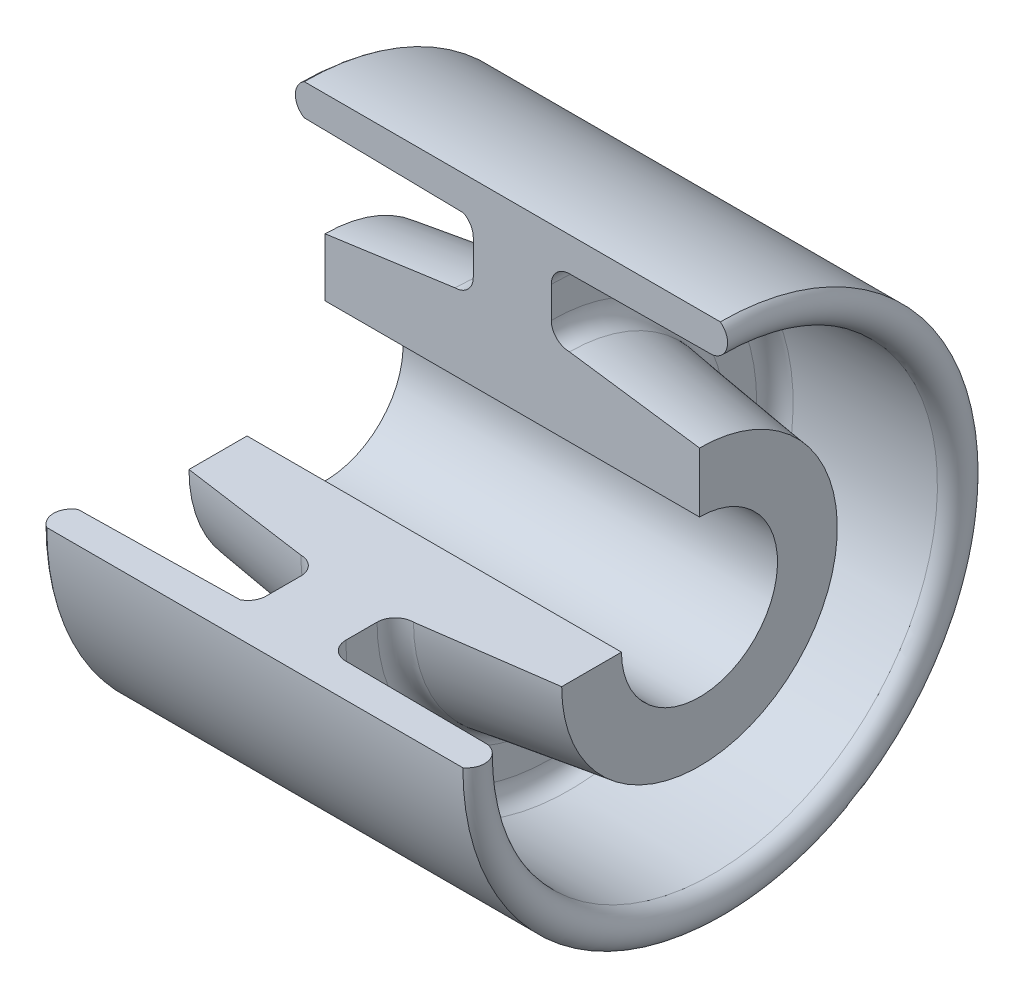
ISO-10303-21;
HEADER;
FILE_DESCRIPTION(('STEP AP214'),'2;1');
FILE_NAME('part.step','',(''),(''),'','','');
FILE_SCHEMA(('AUTOMOTIVE_DESIGN { 1 0 10303 214 1 1 1 1 }'));
ENDSEC;
DATA;
#1=APPLICATION_CONTEXT('core data for automotive mechanical design processes');
#2=APPLICATION_PROTOCOL_DEFINITION('international standard','automotive_design',2000,#1);
#3=PRODUCT_CONTEXT('',#1,'mechanical');
#4=PRODUCT('Part','Part','',(#3));
#5=PRODUCT_RELATED_PRODUCT_CATEGORY('part','',(#4));
#6=PRODUCT_DEFINITION_FORMATION('','',#4);
#7=PRODUCT_DEFINITION_CONTEXT('part definition',#1,'design');
#8=PRODUCT_DEFINITION('design','',#6,#7);
#9=PRODUCT_DEFINITION_SHAPE('','',#8);
#10=(LENGTH_UNIT() NAMED_UNIT(*) SI_UNIT(.MILLI.,.METRE.));
#11=(NAMED_UNIT(*) PLANE_ANGLE_UNIT() SI_UNIT($,.RADIAN.));
#12=(NAMED_UNIT(*) SI_UNIT($,.STERADIAN.) SOLID_ANGLE_UNIT());
#13=UNCERTAINTY_MEASURE_WITH_UNIT(LENGTH_MEASURE(1.E-05),#10,'distance_accuracy_value','');
#14=(GEOMETRIC_REPRESENTATION_CONTEXT(3) GLOBAL_UNCERTAINTY_ASSIGNED_CONTEXT((#13)) GLOBAL_UNIT_ASSIGNED_CONTEXT((#10,
#11,#12)) REPRESENTATION_CONTEXT('',''));
#15=CARTESIAN_POINT('',(0.,0.,0.));
#16=DIRECTION('',(0.,0.,1.));
#17=DIRECTION('',(1.,0.,0.));
#18=AXIS2_PLACEMENT_3D('',#15,#16,#17);
#19=CARTESIAN_POINT('',(-48.8480035448024,-18.9717920228078,0.));
#20=DIRECTION('',(1.,0.,0.));
#21=DIRECTION('',(0.,0.,-1.));
#22=AXIS2_PLACEMENT_3D('',#19,#20,#21);
#23=TOROIDAL_SURFACE('',#22,46.4888835818629,3.5);
#24=CARTESIAN_POINT('',(-50.632149815831,-18.9717920228078,0.));
#25=DIRECTION('',(1.,0.,0.));
#26=DIRECTION('',(0.,0.,-1.));
#27=AXIS2_PLACEMENT_3D('',#24,#25,#26);
#28=CIRCLE('',#27,43.4777671637258);
#29=CARTESIAN_POINT('',(-50.632149815831,-18.9717920228073,43.4777671637258));
#30=VERTEX_POINT('',#29);
#31=CARTESIAN_POINT('',(-50.632149815831,24.505975140918,0.));
#32=VERTEX_POINT('',#31);
#33=EDGE_CURVE('E11',#30,#32,#28,.T.);
#34=ORIENTED_EDGE('',*,*,#33,.T.);
#35=CARTESIAN_POINT('',(-48.8480035448024,27.5170915590551,0.));
#36=DIRECTION('',(0.,0.,1.));
#37=DIRECTION('',(1.,0.,0.));
#38=AXIS2_PLACEMENT_3D('',#35,#36,#37);
#39=CIRCLE('',#38,3.5);
#40=CARTESIAN_POINT('',(-50.632149815831,30.5282079771922,0.));
#41=VERTEX_POINT('',#40);
#42=EDGE_CURVE('E148',#41,#32,#39,.T.);
#43=ORIENTED_EDGE('',*,*,#42,.F.);
#44=CARTESIAN_POINT('',(-50.632149815831,-18.9717920228078,0.));
#45=DIRECTION('',(1.,0.,0.));
#46=DIRECTION('',(0.,0.,-1.));
#47=AXIS2_PLACEMENT_3D('',#44,#45,#46);
#48=CIRCLE('',#47,49.5);
#49=CARTESIAN_POINT('',(-50.632149815831,-18.9717920228073,49.5));
#50=VERTEX_POINT('',#49);
#51=EDGE_CURVE('E51',#50,#41,#48,.T.);
#52=ORIENTED_EDGE('',*,*,#51,.F.);
#53=CARTESIAN_POINT('',(-48.8480035448024,-18.9717920228073,46.4888835818629));
#54=DIRECTION('',(0.,-1.,0.));
#55=DIRECTION('',(1.,0.,0.));
#56=AXIS2_PLACEMENT_3D('',#53,#54,#55);
#57=CIRCLE('',#56,3.5);
#58=EDGE_CURVE('E150',#50,#30,#57,.T.);
#59=ORIENTED_EDGE('',*,*,#58,.T.);
#60=EDGE_LOOP('',(#34,#43,#52,#59));
#61=FACE_BOUND('',#60,.T.);
#62=ADVANCED_FACE('F36',(#61),#23,.T.);
#63=CARTESIAN_POINT('',(-50.632149815831,-18.9717920228078,0.));
#64=DIRECTION('',(-1.,0.,0.));
#65=DIRECTION('',(0.,0.,1.));
#66=AXIS2_PLACEMENT_3D('',#63,#64,#65);
#67=CONICAL_SURFACE('',#66,43.4777671637258,0.0173716037724723);
#68=CARTESIAN_POINT('',(-20.0232094755942,-18.9717920228078,0.));
#69=DIRECTION('',(1.,0.,0.));
#70=DIRECTION('',(0.,0.,-1.));
#71=AXIS2_PLACEMENT_3D('',#68,#69,#70);
#72=CIRCLE('',#71,42.9459872869619);
#73=CARTESIAN_POINT('',(-20.0232094755942,-18.9717920228074,42.9459872869619));
#74=VERTEX_POINT('',#73);
#75=CARTESIAN_POINT('',(-20.0232094755942,23.9741952641541,0.));
#76=VERTEX_POINT('',#75);
#77=EDGE_CURVE('E44',#74,#76,#72,.T.);
#78=ORIENTED_EDGE('',*,*,#77,.T.);
#79=DIRECTION('',(0.999849117485594,-0.0173707300732649,0.));
#80=VECTOR('',#79,1.);
#81=CARTESIAN_POINT('',(-50.632149815831,24.505975140918,0.));
#82=LINE('',#81,#80);
#83=EDGE_CURVE('E159',#32,#76,#82,.T.);
#84=ORIENTED_EDGE('',*,*,#83,.F.);
#85=ORIENTED_EDGE('',*,*,#33,.F.);
#86=DIRECTION('',(0.999849117485594,0.,-0.0173707300732649));
#87=VECTOR('',#86,1.);
#88=CARTESIAN_POINT('',(-50.632149815831,-18.9717920228073,43.4777671637258));
#89=LINE('',#88,#87);
#90=EDGE_CURVE('E205',#30,#74,#89,.T.);
#91=ORIENTED_EDGE('',*,*,#90,.T.);
#92=EDGE_LOOP('',(#78,#84,#85,#91));
#93=FACE_BOUND('',#92,.T.);
#94=ADVANCED_FACE('F38',(#93),#67,.F.);
#95=CARTESIAN_POINT('',(-21.632149815831,-18.9717920228078,0.));
#96=DIRECTION('',(1.,0.,0.));
#97=DIRECTION('',(0.,0.,-1.));
#98=AXIS2_PLACEMENT_3D('',#95,#96,#97);
#99=TOROIDAL_SURFACE('',#98,39.8377223398316,3.5);
#100=CARTESIAN_POINT('',(-18.132149815831,-18.9717920228078,0.));
#101=DIRECTION('',(1.,0.,0.));
#102=DIRECTION('',(0.,0.,-1.));
#103=AXIS2_PLACEMENT_3D('',#100,#101,#102);
#104=CIRCLE('',#103,39.8377223398316);
#105=CARTESIAN_POINT('',(-18.132149815831,-18.9717920228074,39.8377223398316));
#106=VERTEX_POINT('',#105);
#107=CARTESIAN_POINT('',(-18.132149815831,20.8659303170238,0.));
#108=VERTEX_POINT('',#107);
#109=EDGE_CURVE('E271',#106,#108,#104,.T.);
#110=ORIENTED_EDGE('',*,*,#109,.T.);
#111=CARTESIAN_POINT('',(-21.632149815831,20.8659303170238,0.));
#112=DIRECTION('',(0.,0.,-1.));
#113=DIRECTION('',(1.,0.,0.));
#114=AXIS2_PLACEMENT_3D('',#111,#112,#113);
#115=CIRCLE('',#114,3.5);
#116=EDGE_CURVE('E164',#76,#108,#115,.T.);
#117=ORIENTED_EDGE('',*,*,#116,.F.);
#118=ORIENTED_EDGE('',*,*,#77,.F.);
#119=CARTESIAN_POINT('',(-21.632149815831,-18.9717920228074,39.8377223398316));
#120=DIRECTION('',(0.,1.,0.));
#121=DIRECTION('',(1.,0.,0.));
#122=AXIS2_PLACEMENT_3D('',#119,#120,#121);
#123=CIRCLE('',#122,3.5);
#124=EDGE_CURVE('E207',#74,#106,#123,.T.);
#125=ORIENTED_EDGE('',*,*,#124,.T.);
#126=EDGE_LOOP('',(#110,#117,#118,#125));
#127=FACE_BOUND('',#126,.T.);
#128=ADVANCED_FACE('F273',(#127),#99,.F.);
#129=CARTESIAN_POINT('',(-18.132149815831,-18.9717920228074,39.8377223398316));
#130=DIRECTION('',(-1.,0.,0.));
#131=DIRECTION('',(0.,0.,1.));
#132=AXIS2_PLACEMENT_3D('',#129,#130,#131);
#133=PLANE('',#132);
#134=CARTESIAN_POINT('',(-18.132149815831,-18.9717920228078,0.));
#135=DIRECTION('',(1.,0.,0.));
#136=DIRECTION('',(0.,0.,-1.));
#137=AXIS2_PLACEMENT_3D('',#134,#135,#136);
#138=CIRCLE('',#137,33.1622776601684);
#139=CARTESIAN_POINT('',(-18.132149815831,-18.9717920228075,33.1622776601684));
#140=VERTEX_POINT('',#139);
#141=CARTESIAN_POINT('',(-18.132149815831,14.1904856373606,0.));
#142=VERTEX_POINT('',#141);
#143=EDGE_CURVE('E269',#140,#142,#138,.T.);
#144=ORIENTED_EDGE('',*,*,#143,.T.);
#145=DIRECTION('',(0.,-1.,0.));
#146=VECTOR('',#145,1.);
#147=CARTESIAN_POINT('',(-18.132149815831,20.8659303170238,0.));
#148=LINE('',#147,#146);
#149=EDGE_CURVE('E166',#108,#142,#148,.T.);
#150=ORIENTED_EDGE('',*,*,#149,.F.);
#151=ORIENTED_EDGE('',*,*,#109,.F.);
#152=DIRECTION('',(0.,0.,-1.));
#153=VECTOR('',#152,1.);
#154=CARTESIAN_POINT('',(-18.132149815831,-18.9717920228074,39.8377223398316));
#155=LINE('',#154,#153);
#156=EDGE_CURVE('E210',#106,#140,#155,.T.);
#157=ORIENTED_EDGE('',*,*,#156,.T.);
#158=EDGE_LOOP('',(#144,#150,#151,#157));
#159=FACE_BOUND('',#158,.T.);
#160=ADVANCED_FACE('F279',(#159),#133,.T.);
#161=CARTESIAN_POINT('',(-21.632149815831,-18.9717920228078,0.));
#162=DIRECTION('',(1.,0.,0.));
#163=DIRECTION('',(0.,0.,-1.));
#164=AXIS2_PLACEMENT_3D('',#161,#162,#163);
#165=TOROIDAL_SURFACE('',#164,33.1622776601684,3.5);
#166=CARTESIAN_POINT('',(-21.632149815831,-18.9717920228078,0.));
#167=DIRECTION('',(1.,0.,0.));
#168=DIRECTION('',(0.,0.,-1.));
#169=AXIS2_PLACEMENT_3D('',#166,#167,#168);
#170=CIRCLE('',#169,29.6622776601684);
#171=CARTESIAN_POINT('',(-21.632149815831,-18.9717920228075,29.6622776601684));
#172=VERTEX_POINT('',#171);
#173=CARTESIAN_POINT('',(-21.632149815831,10.6904856373606,0.));
#174=VERTEX_POINT('',#173);
#175=EDGE_CURVE('E267',#172,#174,#170,.T.);
#176=ORIENTED_EDGE('',*,*,#175,.T.);
#177=CARTESIAN_POINT('',(-21.632149815831,14.1904856373606,0.));
#178=DIRECTION('',(0.,0.,-1.));
#179=DIRECTION('',(1.,0.,0.));
#180=AXIS2_PLACEMENT_3D('',#177,#178,#179);
#181=CIRCLE('',#180,3.5);
#182=EDGE_CURVE('E171',#142,#174,#181,.T.);
#183=ORIENTED_EDGE('',*,*,#182,.F.);
#184=ORIENTED_EDGE('',*,*,#143,.F.);
#185=CARTESIAN_POINT('',(-21.632149815831,-18.9717920228075,33.1622776601684));
#186=DIRECTION('',(0.,1.,0.));
#187=DIRECTION('',(1.,0.,0.));
#188=AXIS2_PLACEMENT_3D('',#185,#186,#187);
#189=CIRCLE('',#188,3.5);
#190=EDGE_CURVE('E213',#140,#172,#189,.T.);
#191=ORIENTED_EDGE('',*,*,#190,.T.);
#192=EDGE_LOOP('',(#176,#183,#184,#191));
#193=FACE_BOUND('',#192,.T.);
#194=ADVANCED_FACE('F282',(#193),#165,.F.);
#195=CARTESIAN_POINT('',(-21.632149815831,-18.9717920228078,0.));
#196=DIRECTION('',(1.,0.,0.));
#197=DIRECTION('',(0.,0.,-1.));
#198=AXIS2_PLACEMENT_3D('',#195,#196,#197);
#199=CONICAL_SURFACE('',#198,29.6622776601684,0.139095941482072);
#200=CARTESIAN_POINT('',(-46.632149815831,-18.9717920228078,0.));
#201=DIRECTION('',(1.,0.,0.));
#202=DIRECTION('',(0.,0.,-1.));
#203=AXIS2_PLACEMENT_3D('',#200,#201,#202);
#204=CIRCLE('',#203,26.1622776601684);
#205=CARTESIAN_POINT('',(-46.632149815831,-18.9717920228075,26.1622776601684));
#206=VERTEX_POINT('',#205);
#207=CARTESIAN_POINT('',(-46.632149815831,7.19048563736057,0.));
#208=VERTEX_POINT('',#207);
#209=EDGE_CURVE('E265',#206,#208,#204,.T.);
#210=ORIENTED_EDGE('',*,*,#209,.T.);
#211=DIRECTION('',(-0.99034174667433,-0.138647844534407,0.));
#212=VECTOR('',#211,1.);
#213=CARTESIAN_POINT('',(-46.632149815831,7.19048563736057,0.));
#214=LINE('',#213,#212);
#215=EDGE_CURVE('E174',#174,#208,#214,.T.);
#216=ORIENTED_EDGE('',*,*,#215,.F.);
#217=ORIENTED_EDGE('',*,*,#175,.F.);
#218=DIRECTION('',(-0.99034174667433,0.,-0.138647844534407));
#219=VECTOR('',#218,1.);
#220=CARTESIAN_POINT('',(-46.632149815831,-18.9717920228075,26.1622776601684));
#221=LINE('',#220,#219);
#222=EDGE_CURVE('E216',#172,#206,#221,.T.);
#223=ORIENTED_EDGE('',*,*,#222,.T.);
#224=EDGE_LOOP('',(#210,#216,#217,#223));
#225=FACE_BOUND('',#224,.T.);
#226=ADVANCED_FACE('F287',(#225),#199,.T.);
#227=CARTESIAN_POINT('',(-46.632149815831,-18.9717920228076,15.));
#228=DIRECTION('',(-1.,0.,0.));
#229=DIRECTION('',(0.,0.,1.));
#230=AXIS2_PLACEMENT_3D('',#227,#228,#229);
#231=PLANE('',#230);
#232=CARTESIAN_POINT('',(-46.632149815831,-18.9717920228078,0.));
#233=DIRECTION('',(1.,0.,0.));
#234=DIRECTION('',(0.,0.,-1.));
#235=AXIS2_PLACEMENT_3D('',#232,#233,#234);
#236=CIRCLE('',#235,15.);
#237=CARTESIAN_POINT('',(-46.632149815831,-18.9717920228076,15.));
#238=VERTEX_POINT('',#237);
#239=CARTESIAN_POINT('',(-46.632149815831,-3.97179202280781,0.));
#240=VERTEX_POINT('',#239);
#241=EDGE_CURVE('E263',#238,#240,#236,.T.);
#242=ORIENTED_EDGE('',*,*,#241,.T.);
#243=DIRECTION('',(0.,-1.,0.));
#244=VECTOR('',#243,1.);
#245=CARTESIAN_POINT('',(-46.632149815831,-3.97179202280781,0.));
#246=LINE('',#245,#244);
#247=EDGE_CURVE('E177',#208,#240,#246,.T.);
#248=ORIENTED_EDGE('',*,*,#247,.F.);
#249=ORIENTED_EDGE('',*,*,#209,.F.);
#250=DIRECTION('',(0.,0.,-1.));
#251=VECTOR('',#250,1.);
#252=CARTESIAN_POINT('',(-46.632149815831,-18.9717920228076,15.));
#253=LINE('',#252,#251);
#254=EDGE_CURVE('E219',#206,#238,#253,.T.);
#255=ORIENTED_EDGE('',*,*,#254,.T.);
#256=EDGE_LOOP('',(#242,#248,#249,#255));
#257=FACE_BOUND('',#256,.T.);
#258=ADVANCED_FACE('F290',(#257),#231,.T.);
#259=CARTESIAN_POINT('',(35.3913131479671,-18.9717920228078,0.));
#260=DIRECTION('',(1.,0.,0.));
#261=DIRECTION('',(0.,0.,-1.));
#262=AXIS2_PLACEMENT_3D('',#259,#260,#261);
#263=CYLINDRICAL_SURFACE('',#262,15.);
#264=CARTESIAN_POINT('',(25.367850184169,-18.9717920228078,0.));
#265=DIRECTION('',(1.,0.,0.));
#266=DIRECTION('',(0.,0.,-1.));
#267=AXIS2_PLACEMENT_3D('',#264,#265,#266);
#268=CIRCLE('',#267,15.);
#269=CARTESIAN_POINT('',(25.367850184169,-18.9717920228076,15.));
#270=VERTEX_POINT('',#269);
#271=CARTESIAN_POINT('',(25.367850184169,-3.97179202280779,0.));
#272=VERTEX_POINT('',#271);
#273=EDGE_CURVE('E261',#270,#272,#268,.T.);
#274=ORIENTED_EDGE('',*,*,#273,.T.);
#275=DIRECTION('',(1.,0.,0.));
#276=VECTOR('',#275,1.);
#277=CARTESIAN_POINT('',(-46.632149815831,-3.97179202280781,0.));
#278=LINE('',#277,#276);
#279=EDGE_CURVE('E180',#240,#272,#278,.T.);
#280=ORIENTED_EDGE('',*,*,#279,.F.);
#281=ORIENTED_EDGE('',*,*,#241,.F.);
#282=DIRECTION('',(1.,0.,0.));
#283=VECTOR('',#282,1.);
#284=CARTESIAN_POINT('',(-46.632149815831,-18.9717920228076,15.));
#285=LINE('',#284,#283);
#286=EDGE_CURVE('E222',#238,#270,#285,.T.);
#287=ORIENTED_EDGE('',*,*,#286,.T.);
#288=EDGE_LOOP('',(#274,#280,#281,#287));
#289=FACE_BOUND('',#288,.T.);
#290=ADVANCED_FACE('F295',(#289),#263,.F.);
#291=CARTESIAN_POINT('',(25.367850184169,-18.9717920228076,15.));
#292=DIRECTION('',(1.,0.,0.));
#293=DIRECTION('',(0.,0.,-1.));
#294=AXIS2_PLACEMENT_3D('',#291,#292,#293);
#295=PLANE('',#294);
#296=CARTESIAN_POINT('',(25.367850184169,-18.9717920228078,0.));
#297=DIRECTION('',(1.,0.,0.));
#298=DIRECTION('',(0.,0.,-1.));
#299=AXIS2_PLACEMENT_3D('',#296,#297,#298);
#300=CIRCLE('',#299,26.5);
#301=CARTESIAN_POINT('',(25.367850184169,-18.9717920228075,26.5));
#302=VERTEX_POINT('',#301);
#303=CARTESIAN_POINT('',(25.367850184169,7.52820797719218,0.));
#304=VERTEX_POINT('',#303);
#305=EDGE_CURVE('E259',#302,#304,#300,.T.);
#306=ORIENTED_EDGE('',*,*,#305,.T.);
#307=DIRECTION('',(0.,1.,0.));
#308=VECTOR('',#307,1.);
#309=CARTESIAN_POINT('',(25.367850184169,-3.97179202280779,0.));
#310=LINE('',#309,#308);
#311=EDGE_CURVE('E183',#272,#304,#310,.T.);
#312=ORIENTED_EDGE('',*,*,#311,.F.);
#313=ORIENTED_EDGE('',*,*,#273,.F.);
#314=DIRECTION('',(0.,0.,1.));
#315=VECTOR('',#314,1.);
#316=CARTESIAN_POINT('',(25.367850184169,-18.9717920228076,15.));
#317=LINE('',#316,#315);
#318=EDGE_CURVE('E225',#270,#302,#317,.T.);
#319=ORIENTED_EDGE('',*,*,#318,.T.);
#320=EDGE_LOOP('',(#306,#312,#313,#319));
#321=FACE_BOUND('',#320,.T.);
#322=ADVANCED_FACE('F298',(#321),#295,.T.);
#323=CARTESIAN_POINT('',(25.367850184169,-18.9717920228078,0.));
#324=DIRECTION('',(-1.,0.,0.));
#325=DIRECTION('',(0.,0.,1.));
#326=AXIS2_PLACEMENT_3D('',#323,#324,#325);
#327=CONICAL_SURFACE('',#326,26.5,0.139095941482072);
#328=CARTESIAN_POINT('',(0.367850184169023,-18.9717920228078,0.));
#329=DIRECTION('',(1.,0.,0.));
#330=DIRECTION('',(0.,0.,-1.));
#331=AXIS2_PLACEMENT_3D('',#328,#329,#330);
#332=CIRCLE('',#331,30.);
#333=CARTESIAN_POINT('',(0.36785018416902,-18.9717920228075,30.));
#334=VERTEX_POINT('',#333);
#335=CARTESIAN_POINT('',(0.36785018416902,11.0282079771922,0.));
#336=VERTEX_POINT('',#335);
#337=EDGE_CURVE('E257',#334,#336,#332,.T.);
#338=ORIENTED_EDGE('',*,*,#337,.T.);
#339=DIRECTION('',(-0.99034174667433,0.138647844534407,0.));
#340=VECTOR('',#339,1.);
#341=CARTESIAN_POINT('',(25.367850184169,7.52820797719218,0.));
#342=LINE('',#341,#340);
#343=EDGE_CURVE('E186',#304,#336,#342,.T.);
#344=ORIENTED_EDGE('',*,*,#343,.F.);
#345=ORIENTED_EDGE('',*,*,#305,.F.);
#346=DIRECTION('',(-0.99034174667433,0.,0.138647844534407));
#347=VECTOR('',#346,1.);
#348=CARTESIAN_POINT('',(25.367850184169,-18.9717920228075,26.5));
#349=LINE('',#348,#347);
#350=EDGE_CURVE('E228',#302,#334,#349,.T.);
#351=ORIENTED_EDGE('',*,*,#350,.T.);
#352=EDGE_LOOP('',(#338,#344,#345,#351));
#353=FACE_BOUND('',#352,.T.);
#354=ADVANCED_FACE('F303',(#353),#327,.T.);
#355=CARTESIAN_POINT('',(0.367850184169027,-18.9717920228078,0.));
#356=DIRECTION('',(1.,0.,0.));
#357=DIRECTION('',(0.,0.,-1.));
#358=AXIS2_PLACEMENT_3D('',#355,#356,#357);
#359=TOROIDAL_SURFACE('',#358,33.5,3.5);
#360=CARTESIAN_POINT('',(-3.13214981583097,-18.9717920228078,0.));
#361=DIRECTION('',(1.,0.,0.));
#362=DIRECTION('',(0.,0.,-1.));
#363=AXIS2_PLACEMENT_3D('',#360,#361,#362);
#364=CIRCLE('',#363,33.5);
#365=CARTESIAN_POINT('',(-3.13214981583097,-18.9717920228075,33.5));
#366=VERTEX_POINT('',#365);
#367=CARTESIAN_POINT('',(-3.13214981583097,14.5282079771922,0.));
#368=VERTEX_POINT('',#367);
#369=EDGE_CURVE('E255',#366,#368,#364,.T.);
#370=ORIENTED_EDGE('',*,*,#369,.T.);
#371=CARTESIAN_POINT('',(0.367850184169027,14.5282079771922,0.));
#372=DIRECTION('',(0.,0.,-1.));
#373=DIRECTION('',(1.,0.,0.));
#374=AXIS2_PLACEMENT_3D('',#371,#372,#373);
#375=CIRCLE('',#374,3.5);
#376=EDGE_CURVE('E189',#336,#368,#375,.T.);
#377=ORIENTED_EDGE('',*,*,#376,.F.);
#378=ORIENTED_EDGE('',*,*,#337,.F.);
#379=CARTESIAN_POINT('',(0.367850184169027,-18.9717920228075,33.5));
#380=DIRECTION('',(0.,1.,0.));
#381=DIRECTION('',(1.,0.,0.));
#382=AXIS2_PLACEMENT_3D('',#379,#380,#381);
#383=CIRCLE('',#382,3.5);
#384=EDGE_CURVE('E231',#334,#366,#383,.T.);
#385=ORIENTED_EDGE('',*,*,#384,.T.);
#386=EDGE_LOOP('',(#370,#377,#378,#385));
#387=FACE_BOUND('',#386,.T.);
#388=ADVANCED_FACE('F306',(#387),#359,.F.);
#389=CARTESIAN_POINT('',(-3.13214981583097,-18.9717920228074,39.5));
#390=DIRECTION('',(1.,0.,0.));
#391=DIRECTION('',(0.,0.,-1.));
#392=AXIS2_PLACEMENT_3D('',#389,#390,#391);
#393=PLANE('',#392);
#394=CARTESIAN_POINT('',(-3.13214981583097,-18.9717920228078,0.));
#395=DIRECTION('',(1.,0.,0.));
#396=DIRECTION('',(0.,0.,-1.));
#397=AXIS2_PLACEMENT_3D('',#394,#395,#396);
#398=CIRCLE('',#397,39.5);
#399=CARTESIAN_POINT('',(-3.13214981583097,-18.9717920228074,39.5));
#400=VERTEX_POINT('',#399);
#401=CARTESIAN_POINT('',(-3.13214981583097,20.5282079771922,0.));
#402=VERTEX_POINT('',#401);
#403=EDGE_CURVE('E253',#400,#402,#398,.T.);
#404=ORIENTED_EDGE('',*,*,#403,.T.);
#405=DIRECTION('',(0.,1.,0.));
#406=VECTOR('',#405,1.);
#407=CARTESIAN_POINT('',(-3.13214981583097,20.5282079771922,0.));
#408=LINE('',#407,#406);
#409=EDGE_CURVE('E192',#368,#402,#408,.T.);
#410=ORIENTED_EDGE('',*,*,#409,.F.);
#411=ORIENTED_EDGE('',*,*,#369,.F.);
#412=DIRECTION('',(0.,0.,1.));
#413=VECTOR('',#412,1.);
#414=CARTESIAN_POINT('',(-3.13214981583097,-18.9717920228074,39.5));
#415=LINE('',#414,#413);
#416=EDGE_CURVE('E234',#366,#400,#415,.T.);
#417=ORIENTED_EDGE('',*,*,#416,.T.);
#418=EDGE_LOOP('',(#404,#410,#411,#417));
#419=FACE_BOUND('',#418,.T.);
#420=ADVANCED_FACE('F311',(#419),#393,.T.);
#421=CARTESIAN_POINT('',(0.367850184169026,-18.9717920228078,0.));
#422=DIRECTION('',(1.,0.,0.));
#423=DIRECTION('',(0.,0.,-1.));
#424=AXIS2_PLACEMENT_3D('',#421,#422,#423);
#425=TOROIDAL_SURFACE('',#424,39.5,3.5);
#426=CARTESIAN_POINT('',(0.367850184169023,-18.9717920228078,0.));
#427=DIRECTION('',(1.,0.,0.));
#428=DIRECTION('',(0.,0.,-1.));
#429=AXIS2_PLACEMENT_3D('',#426,#427,#428);
#430=CIRCLE('',#429,43.);
#431=CARTESIAN_POINT('',(0.367850184169026,-18.9717920228074,43.));
#432=VERTEX_POINT('',#431);
#433=CARTESIAN_POINT('',(0.367850184169026,24.0282079771922,0.));
#434=VERTEX_POINT('',#433);
#435=EDGE_CURVE('E251',#432,#434,#430,.T.);
#436=ORIENTED_EDGE('',*,*,#435,.T.);
#437=CARTESIAN_POINT('',(0.367850184169026,20.5282079771922,0.));
#438=DIRECTION('',(0.,0.,-1.));
#439=DIRECTION('',(1.,0.,0.));
#440=AXIS2_PLACEMENT_3D('',#437,#438,#439);
#441=CIRCLE('',#440,3.5);
#442=EDGE_CURVE('E195',#402,#434,#441,.T.);
#443=ORIENTED_EDGE('',*,*,#442,.F.);
#444=ORIENTED_EDGE('',*,*,#403,.F.);
#445=CARTESIAN_POINT('',(0.367850184169026,-18.9717920228074,39.5));
#446=DIRECTION('',(0.,1.,0.));
#447=DIRECTION('',(1.,0.,0.));
#448=AXIS2_PLACEMENT_3D('',#445,#446,#447);
#449=CIRCLE('',#448,3.5);
#450=EDGE_CURVE('E237',#400,#432,#449,.T.);
#451=ORIENTED_EDGE('',*,*,#450,.T.);
#452=EDGE_LOOP('',(#436,#443,#444,#451));
#453=FACE_BOUND('',#452,.T.);
#454=ADVANCED_FACE('F314',(#453),#425,.F.);
#455=CARTESIAN_POINT('',(0.367850184169023,-18.9717920228078,0.));
#456=DIRECTION('',(1.,0.,0.));
#457=DIRECTION('',(0.,0.,-1.));
#458=AXIS2_PLACEMENT_3D('',#455,#456,#457);
#459=CONICAL_SURFACE('',#458,43.,0.00903160452652656);
#460=CARTESIAN_POINT('',(27.867850184169,-18.9717920228078,0.));
#461=DIRECTION('',(1.,0.,0.));
#462=DIRECTION('',(0.,0.,-1.));
#463=AXIS2_PLACEMENT_3D('',#460,#461,#462);
#464=CIRCLE('',#463,43.2483758778464);
#465=CARTESIAN_POINT('',(27.867850184169,-18.9717920228074,43.2483758778464));
#466=VERTEX_POINT('',#465);
#467=CARTESIAN_POINT('',(27.867850184169,24.2765838550386,0.));
#468=VERTEX_POINT('',#467);
#469=EDGE_CURVE('E249',#466,#468,#464,.T.);
#470=ORIENTED_EDGE('',*,*,#469,.T.);
#471=DIRECTION('',(0.999959215337073,0.00903148174254394,0.));
#472=VECTOR('',#471,1.);
#473=CARTESIAN_POINT('',(27.867850184169,24.2765838550386,0.));
#474=LINE('',#473,#472);
#475=EDGE_CURVE('E198',#434,#468,#474,.T.);
#476=ORIENTED_EDGE('',*,*,#475,.F.);
#477=ORIENTED_EDGE('',*,*,#435,.F.);
#478=DIRECTION('',(0.999959215337073,0.,0.00903148174254394));
#479=VECTOR('',#478,1.);
#480=CARTESIAN_POINT('',(27.867850184169,-18.9717920228074,43.2483758778464));
#481=LINE('',#480,#479);
#482=EDGE_CURVE('E240',#432,#466,#481,.T.);
#483=ORIENTED_EDGE('',*,*,#482,.T.);
#484=EDGE_LOOP('',(#470,#476,#477,#483));
#485=FACE_BOUND('',#484,.T.);
#486=ADVANCED_FACE('F319',(#485),#459,.F.);
#487=CARTESIAN_POINT('',(27.2715754186887,-18.9717920228078,0.));
#488=DIRECTION('',(1.,0.,0.));
#489=DIRECTION('',(0.,0.,-1.));
#490=AXIS2_PLACEMENT_3D('',#487,#488,#489);
#491=TOROIDAL_SURFACE('',#490,46.6972099422878,3.49999999999999);
#492=CARTESIAN_POINT('',(29.367850184169,-18.9717920228078,0.));
#493=DIRECTION('',(1.,0.,0.));
#494=DIRECTION('',(0.,0.,-1.));
#495=AXIS2_PLACEMENT_3D('',#492,#493,#494);
#496=CIRCLE('',#495,49.5);
#497=CARTESIAN_POINT('',(29.367850184169,-18.9717920228073,49.5));
#498=VERTEX_POINT('',#497);
#499=CARTESIAN_POINT('',(29.367850184169,30.5282079771922,0.));
#500=VERTEX_POINT('',#499);
#501=EDGE_CURVE('E59',#498,#500,#496,.T.);
#502=ORIENTED_EDGE('',*,*,#501,.T.);
#503=CARTESIAN_POINT('',(27.2715754186887,27.72541791948,0.));
#504=DIRECTION('',(0.,0.,1.));
#505=DIRECTION('',(1.,0.,0.));
#506=AXIS2_PLACEMENT_3D('',#503,#504,#505);
#507=CIRCLE('',#506,3.49999999999999);
#508=EDGE_CURVE('E201',#468,#500,#507,.T.);
#509=ORIENTED_EDGE('',*,*,#508,.F.);
#510=ORIENTED_EDGE('',*,*,#469,.F.);
#511=CARTESIAN_POINT('',(27.2715754186887,-18.9717920228073,46.6972099422878));
#512=DIRECTION('',(0.,-1.,0.));
#513=DIRECTION('',(1.,0.,0.));
#514=AXIS2_PLACEMENT_3D('',#511,#512,#513);
#515=CIRCLE('',#514,3.49999999999999);
#516=EDGE_CURVE('E243',#466,#498,#515,.T.);
#517=ORIENTED_EDGE('',*,*,#516,.T.);
#518=EDGE_LOOP('',(#502,#509,#510,#517));
#519=FACE_BOUND('',#518,.T.);
#520=ADVANCED_FACE('F322',(#519),#491,.T.);
#521=CARTESIAN_POINT('',(35.3913131479671,-18.9717920228078,0.));
#522=DIRECTION('',(1.,0.,0.));
#523=DIRECTION('',(0.,0.,-1.));
#524=AXIS2_PLACEMENT_3D('',#521,#522,#523);
#525=CYLINDRICAL_SURFACE('',#524,49.5);
#526=DIRECTION('',(-1.,0.,0.));
#527=VECTOR('',#526,1.);
#528=CARTESIAN_POINT('',(-50.632149815831,-18.9717920228073,49.5));
#529=LINE('',#528,#527);
#530=EDGE_CURVE('E245',#498,#50,#529,.T.);
#531=ORIENTED_EDGE('',*,*,#530,.T.);
#532=ORIENTED_EDGE('',*,*,#51,.T.);
#533=DIRECTION('',(-1.,0.,0.));
#534=VECTOR('',#533,1.);
#535=CARTESIAN_POINT('',(-50.632149815831,30.5282079771922,0.));
#536=LINE('',#535,#534);
#537=EDGE_CURVE('E162',#500,#41,#536,.T.);
#538=ORIENTED_EDGE('',*,*,#537,.F.);
#539=ORIENTED_EDGE('',*,*,#501,.F.);
#540=EDGE_LOOP('',(#531,#532,#538,#539));
#541=FACE_BOUND('',#540,.T.);
#542=ADVANCED_FACE('F324',(#541),#525,.T.);
#543=CARTESIAN_POINT('',(-48.8480035448024,-18.9717920228073,46.4888835818629));
#544=DIRECTION('',(0.,-1.,0.));
#545=DIRECTION('',(1.,0.,0.));
#546=AXIS2_PLACEMENT_3D('',#543,#544,#545);
#547=PLANE('',#546);
#548=ORIENTED_EDGE('',*,*,#58,.F.);
#549=ORIENTED_EDGE('',*,*,#530,.F.);
#550=ORIENTED_EDGE('',*,*,#516,.F.);
#551=ORIENTED_EDGE('',*,*,#482,.F.);
#552=ORIENTED_EDGE('',*,*,#450,.F.);
#553=ORIENTED_EDGE('',*,*,#416,.F.);
#554=ORIENTED_EDGE('',*,*,#384,.F.);
#555=ORIENTED_EDGE('',*,*,#350,.F.);
#556=ORIENTED_EDGE('',*,*,#318,.F.);
#557=ORIENTED_EDGE('',*,*,#286,.F.);
#558=ORIENTED_EDGE('',*,*,#254,.F.);
#559=ORIENTED_EDGE('',*,*,#222,.F.);
#560=ORIENTED_EDGE('',*,*,#190,.F.);
#561=ORIENTED_EDGE('',*,*,#156,.F.);
#562=ORIENTED_EDGE('',*,*,#124,.F.);
#563=ORIENTED_EDGE('',*,*,#90,.F.);
#564=EDGE_LOOP('',(#548,#549,#550,#551,#552,#553,#554,#555,#556,#557,#558,#559,#560,#561,#562,#563));
#565=FACE_BOUND('',#564,.T.);
#566=ADVANCED_FACE('F326',(#565),#547,.F.);
#567=CARTESIAN_POINT('',(-48.8480035448024,27.5170915590551,0.));
#568=DIRECTION('',(0.,0.,1.));
#569=DIRECTION('',(1.,0.,0.));
#570=AXIS2_PLACEMENT_3D('',#567,#568,#569);
#571=PLANE('',#570);
#572=ORIENTED_EDGE('',*,*,#42,.T.);
#573=ORIENTED_EDGE('',*,*,#83,.T.);
#574=ORIENTED_EDGE('',*,*,#116,.T.);
#575=ORIENTED_EDGE('',*,*,#149,.T.);
#576=ORIENTED_EDGE('',*,*,#182,.T.);
#577=ORIENTED_EDGE('',*,*,#215,.T.);
#578=ORIENTED_EDGE('',*,*,#247,.T.);
#579=ORIENTED_EDGE('',*,*,#279,.T.);
#580=ORIENTED_EDGE('',*,*,#311,.T.);
#581=ORIENTED_EDGE('',*,*,#343,.T.);
#582=ORIENTED_EDGE('',*,*,#376,.T.);
#583=ORIENTED_EDGE('',*,*,#409,.T.);
#584=ORIENTED_EDGE('',*,*,#442,.T.);
#585=ORIENTED_EDGE('',*,*,#475,.T.);
#586=ORIENTED_EDGE('',*,*,#508,.T.);
#587=ORIENTED_EDGE('',*,*,#537,.T.);
#588=EDGE_LOOP('',(#572,#573,#574,#575,#576,#577,#578,#579,#580,#581,#582,#583,#584,#585,#586,#587));
#589=FACE_BOUND('',#588,.T.);
#590=ADVANCED_FACE('F157',(#589),#571,.T.);
#591=CLOSED_SHELL('',(#62,#94,#128,#160,#194,#226,#258,#290,#322,#354,#388,#420,#454,#486,#520,
#542,#566,#590));
#592=MANIFOLD_SOLID_BREP('B2',#591);
#593=ADVANCED_BREP_SHAPE_REPRESENTATION('',(#18,#592),#14);
#594=SHAPE_DEFINITION_REPRESENTATION(#9,#593);
ENDSEC;
END-ISO-10303-21;
